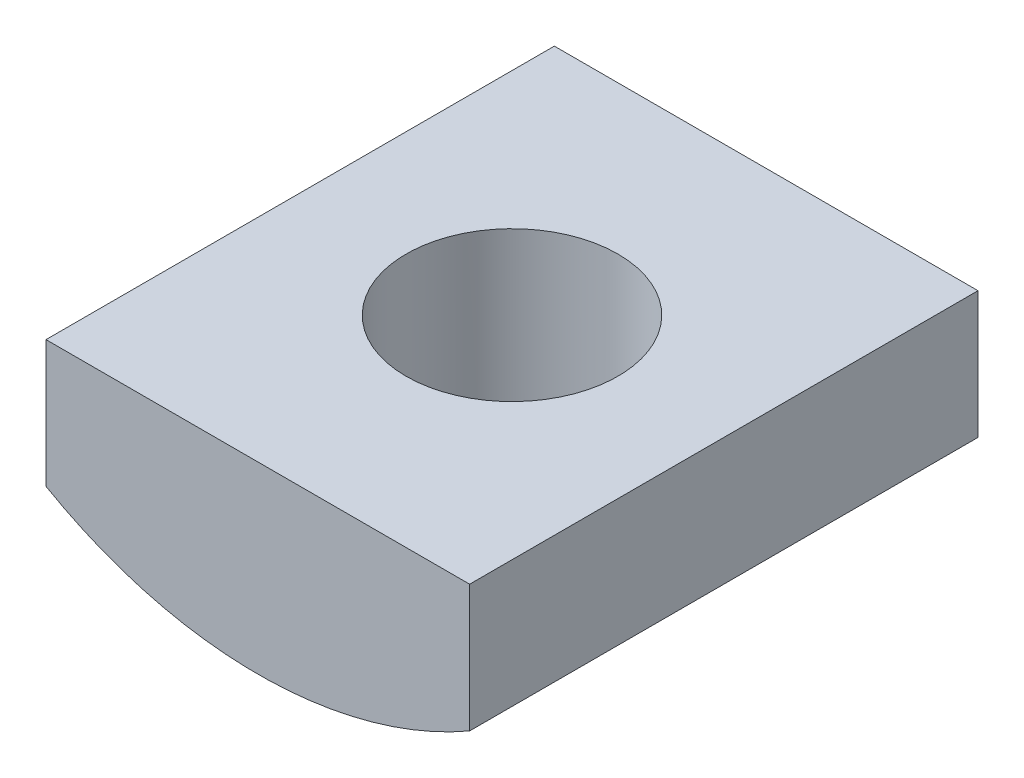
ISO-10303-21;
HEADER;
FILE_DESCRIPTION(('STEP AP214'),'2;1');
FILE_NAME('part.step','',(''),(''),'','','');
FILE_SCHEMA(('AUTOMOTIVE_DESIGN { 1 0 10303 214 1 1 1 1 }'));
ENDSEC;
DATA;
#1=APPLICATION_CONTEXT('core data for automotive mechanical design processes');
#2=APPLICATION_PROTOCOL_DEFINITION('international standard','automotive_design',2000,#1);
#3=PRODUCT_CONTEXT('',#1,'mechanical');
#4=PRODUCT('Part','Part','',(#3));
#5=PRODUCT_RELATED_PRODUCT_CATEGORY('part','',(#4));
#6=PRODUCT_DEFINITION_FORMATION('','',#4);
#7=PRODUCT_DEFINITION_CONTEXT('part definition',#1,'design');
#8=PRODUCT_DEFINITION('design','',#6,#7);
#9=PRODUCT_DEFINITION_SHAPE('','',#8);
#10=(LENGTH_UNIT() NAMED_UNIT(*) SI_UNIT(.MILLI.,.METRE.));
#11=(NAMED_UNIT(*) PLANE_ANGLE_UNIT() SI_UNIT($,.RADIAN.));
#12=(NAMED_UNIT(*) SI_UNIT($,.STERADIAN.) SOLID_ANGLE_UNIT());
#13=UNCERTAINTY_MEASURE_WITH_UNIT(LENGTH_MEASURE(1.E-05),#10,'distance_accuracy_value','');
#14=(GEOMETRIC_REPRESENTATION_CONTEXT(3) GLOBAL_UNCERTAINTY_ASSIGNED_CONTEXT((#13)) GLOBAL_UNIT_ASSIGNED_CONTEXT((#10,
#11,#12)) REPRESENTATION_CONTEXT('',''));
#15=CARTESIAN_POINT('',(0.,0.,0.));
#16=DIRECTION('',(0.,0.,1.));
#17=DIRECTION('',(1.,0.,0.));
#18=AXIS2_PLACEMENT_3D('',#15,#16,#17);
#19=CARTESIAN_POINT('',(-5.,0.,12.));
#20=DIRECTION('',(1.,0.,0.));
#21=DIRECTION('',(0.,1.,0.));
#22=AXIS2_PLACEMENT_3D('',#19,#20,#21);
#23=PLANE('',#22);
#24=DIRECTION('',(0.,-1.,0.));
#25=VECTOR('',#24,1.);
#26=CARTESIAN_POINT('',(-5.,0.,0.));
#27=LINE('',#26,#25);
#28=CARTESIAN_POINT('',(-5.,0.,0.));
#29=VERTEX_POINT('',#28);
#30=CARTESIAN_POINT('',(-5.,-3.,0.));
#31=VERTEX_POINT('',#30);
#32=EDGE_CURVE('E101',#29,#31,#27,.T.);
#33=ORIENTED_EDGE('',*,*,#32,.T.);
#34=DIRECTION('',(0.,0.,-1.));
#35=VECTOR('',#34,1.);
#36=CARTESIAN_POINT('',(-5.,-3.,12.));
#37=LINE('',#36,#35);
#38=CARTESIAN_POINT('',(-5.,-3.,12.));
#39=VERTEX_POINT('',#38);
#40=EDGE_CURVE('E11',#39,#31,#37,.T.);
#41=ORIENTED_EDGE('',*,*,#40,.F.);
#42=DIRECTION('',(0.,-1.,0.));
#43=VECTOR('',#42,1.);
#44=CARTESIAN_POINT('',(-5.,0.,12.));
#45=LINE('',#44,#43);
#46=CARTESIAN_POINT('',(-5.,0.,12.));
#47=VERTEX_POINT('',#46);
#48=EDGE_CURVE('E88',#47,#39,#45,.T.);
#49=ORIENTED_EDGE('',*,*,#48,.F.);
#50=DIRECTION('',(0.,0.,-1.));
#51=VECTOR('',#50,1.);
#52=CARTESIAN_POINT('',(-5.,0.,12.));
#53=LINE('',#52,#51);
#54=EDGE_CURVE('E97',#47,#29,#53,.T.);
#55=ORIENTED_EDGE('',*,*,#54,.T.);
#56=EDGE_LOOP('',(#33,#41,#49,#55));
#57=FACE_BOUND('',#56,.T.);
#58=ADVANCED_FACE('F33',(#57),#23,.F.);
#59=CARTESIAN_POINT('',(0.,5.66025403784439,12.));
#60=DIRECTION('',(0.,0.,-1.));
#61=DIRECTION('',(-1.,0.,0.));
#62=AXIS2_PLACEMENT_3D('',#59,#60,#61);
#63=CYLINDRICAL_SURFACE('',#62,10.);
#64=CARTESIAN_POINT('',(0.,-4.33974596215561,8.5));
#65=CARTESIAN_POINT('',(0.138126814449551,-4.33974362662248,8.49999612376974));
#66=CARTESIAN_POINT('',(0.276296929717938,-4.33685559768605,8.48851408204369));
#67=CARTESIAN_POINT('',(0.54867720628422,-4.32561452598718,8.44295808115499));
#68=CARTESIAN_POINT('',(0.682885078117898,-4.31725838582188,8.40887131743691));
#69=CARTESIAN_POINT('',(0.943368120304293,-4.29600640102282,8.31926791089652));
#70=CARTESIAN_POINT('',(1.06965260571667,-4.28311600952325,8.26377700214122));
#71=CARTESIAN_POINT('',(1.31112021984071,-4.2541683589493,8.13303101659193));
#72=CARTESIAN_POINT('',(1.4263029739146,-4.23811099305822,8.05777527313505));
#73=CARTESIAN_POINT('',(1.64466987883486,-4.2042028553505,7.8879986839097));
#74=CARTESIAN_POINT('',(1.74759281676843,-4.18632441462438,7.79314737506823));
#75=CARTESIAN_POINT('',(1.93624821200553,-4.15097296412122,7.58757965848494));
#76=CARTESIAN_POINT('',(2.02197872824865,-4.13350000032007,7.47686146175511));
#77=CARTESIAN_POINT('',(2.17504423799829,-4.10065889045842,7.24067462210501));
#78=CARTESIAN_POINT('',(2.2420870265419,-4.08532586990246,7.11501128198545));
#79=CARTESIAN_POINT('',(2.35399484758457,-4.05890420912255,6.85375264723328));
#80=CARTESIAN_POINT('',(2.39886342573357,-4.04781489039592,6.71815894444664));
#81=CARTESIAN_POINT('',(2.46425806134127,-4.03142057376099,6.44376083633057));
#82=CARTESIAN_POINT('',(2.48525378055342,-4.02600414543913,6.30507517327001));
#83=CARTESIAN_POINT('',(2.50376962511068,-4.02123533648214,6.02605238500109));
#84=CARTESIAN_POINT('',(2.50129356969685,-4.02188196928776,5.88571553217977));
#85=CARTESIAN_POINT('',(2.47331087439951,-4.02906605410256,5.61097365375775));
#86=CARTESIAN_POINT('',(2.44836390031772,-4.03546034561051,5.47650729755778));
#87=CARTESIAN_POINT('',(2.37704031150499,-4.0531911233401,5.2137315818149));
#88=CARTESIAN_POINT('',(2.33066217011565,-4.06452796164293,5.08542266161847));
#89=CARTESIAN_POINT('',(2.21731579656197,-4.09099786058326,4.83710330624645));
#90=CARTESIAN_POINT('',(2.1501444453882,-4.10616808665255,4.71718971368405));
#91=CARTESIAN_POINT('',(1.99726046002491,-4.13857447625546,4.49013548373863));
#92=CARTESIAN_POINT('',(1.91154458134806,-4.15581100106608,4.38299708655458));
#93=CARTESIAN_POINT('',(1.72110570780203,-4.19101063782047,4.18132730717599));
#94=CARTESIAN_POINT('',(1.61591043027643,-4.20898045345563,4.08724251656442));
#95=CARTESIAN_POINT('',(1.39101986250616,-4.24317872180155,3.9179645958935));
#96=CARTESIAN_POINT('',(1.27132412951324,-4.25940712131241,3.84277204289406));
#97=CARTESIAN_POINT('',(1.02019314780232,-4.28837483039212,3.71324902295936));
#98=CARTESIAN_POINT('',(0.888718988681037,-4.3011019642844,3.65899109957595));
#99=CARTESIAN_POINT('',(0.618126680238136,-4.32154457867922,3.57347115715071));
#100=CARTESIAN_POINT('',(0.47900999858414,-4.32926101781029,3.54220473930311));
#101=CARTESIAN_POINT('',(0.200899950650044,-4.33867095001186,3.50423739073527));
#102=CARTESIAN_POINT('',(0.0619945333136819,-4.3405135206269,3.4969282898745));
#103=CARTESIAN_POINT('',(-0.215054791335849,-4.33839270906315,3.50541500342582));
#104=CARTESIAN_POINT('',(-0.353198766074328,-4.33442984951983,3.52120873799856));
#105=CARTESIAN_POINT('',(-0.622690447960819,-4.32123898094479,3.57495151398563));
#106=CARTESIAN_POINT('',(-0.754108531614584,-4.31208986525208,3.61256877246162));
#107=CARTESIAN_POINT('',(-1.00876215408753,-4.28955773939157,3.7085118067141));
#108=CARTESIAN_POINT('',(-1.13199686505442,-4.27617430165526,3.76683967385537));
#109=CARTESIAN_POINT('',(-1.36920522404972,-4.24630109425931,3.9037268814578));
#110=CARTESIAN_POINT('',(-1.48297573639294,-4.22976041826561,3.98262685399428));
#111=CARTESIAN_POINT('',(-1.69587768940552,-4.19548778195148,4.15798318132862));
#112=CARTESIAN_POINT('',(-1.79500659828875,-4.17775561637139,4.25444256602941));
#113=CARTESIAN_POINT('',(-1.97831761345414,-4.14256191148059,4.46500326807285));
#114=CARTESIAN_POINT('',(-2.06207311270184,-4.12511769853025,4.57947950499927));
#115=CARTESIAN_POINT('',(-2.20918459835604,-4.0929606018563,4.82122105744763));
#116=CARTESIAN_POINT('',(-2.27254149026901,-4.07824759690502,4.94848580495074));
#117=CARTESIAN_POINT('',(-2.37658570101223,-4.05338087410226,5.21150953734373));
#118=CARTESIAN_POINT('',(-2.41740732773931,-4.0432002159137,5.34721271385383));
#119=CARTESIAN_POINT('',(-2.47557609990489,-4.02852502922147,5.62384939642549));
#120=CARTESIAN_POINT('',(-2.49292837912652,-4.02402925719606,5.76478175170242));
#121=CARTESIAN_POINT('',(-2.50339765056083,-4.02132764917174,6.04353503976935));
#122=CARTESIAN_POINT('',(-2.49719649630131,-4.02294484103596,6.18132905854408));
#123=CARTESIAN_POINT('',(-2.46229546385366,-4.03187777887704,6.45383981444378));
#124=CARTESIAN_POINT('',(-2.43359603781098,-4.03919341033293,6.58855661335532));
#125=CARTESIAN_POINT('',(-2.35488553240495,-4.05860030688783,6.85034743177644));
#126=CARTESIAN_POINT('',(-2.30500234113404,-4.07066288276618,6.97746217540055));
#127=CARTESIAN_POINT('',(-2.18544152267504,-4.09820855756401,7.22160897118928));
#128=CARTESIAN_POINT('',(-2.11576115005696,-4.1136921308337,7.33863962197814));
#129=CARTESIAN_POINT('',(-1.95644624772858,-4.14683986654899,7.56259104833676));
#130=CARTESIAN_POINT('',(-1.86633860485376,-4.16455037601863,7.66916845570661));
#131=CARTESIAN_POINT('',(-1.66964895198289,-4.1998797495933,7.86591174132566));
#132=CARTESIAN_POINT('',(-1.56306303543524,-4.21749859093983,7.95607371685494));
#133=CARTESIAN_POINT('',(-1.33411264450432,-4.25104022295011,8.11901884760768));
#134=CARTESIAN_POINT('',(-1.21149737052731,-4.26692651825344,8.19145768945263));
#135=CARTESIAN_POINT('',(-0.955443432517458,-4.29482804507422,8.31457910490088));
#136=CARTESIAN_POINT('',(-0.822012605727898,-4.30684604881863,8.36527726774756));
#137=CARTESIAN_POINT('',(-0.574017088739118,-4.32388028824798,8.43595305054942));
#138=CARTESIAN_POINT('',(-0.460633618180113,-4.32978904636712,8.45991873842239));
#139=CARTESIAN_POINT('',(-0.231510119227139,-4.33772271602142,8.4919432393699));
#140=CARTESIAN_POINT('',(-0.115770268737694,-4.33974791967052,8.50000324884217));
#141=CARTESIAN_POINT('',(0.,-4.33974596215561,8.5));
#142=B_SPLINE_CURVE_WITH_KNOTS('',3,(#64,#65,#66,#67,#68,#69,#70,#71,#72,#73,#74,#75,#76,#77,
#78,#79,#80,#81,#82,#83,#84,#85,#86,#87,#88,#89,#90,#91,#92,#93,#94,#95,#96,#97,#98,#99,#100,
#101,#102,#103,#104,#105,#106,#107,#108,#109,#110,#111,#112,#113,#114,#115,#116,#117,#118,#119,
#120,#121,#122,#123,#124,#125,#126,#127,#128,#129,#130,#131,#132,#133,#134,#135,#136,#137,#138,
#139,#140,#141),.UNSPECIFIED.,.T.,.F.,(4,2,2,2,2,2,2,2,2,2,2,2,2,2,2,2,2,2,2,2,2,2,2,2,2,2,2,2,
2,2,2,2,2,2,2,2,2,2,4),(0.,0.413956187453149,0.828147062939833,1.24184150381018,
1.65554990028221,2.07690725728565,2.4983121596677,2.92597745909678,3.3535743528228,
3.77260491835116,4.19156730193363,4.60037495017231,5.00921172448932,5.42217546462,
5.83521151399139,6.26002501620567,6.68485149269279,7.11113715020724,7.53734122819939,
7.95263848254328,8.36789835193439,8.7770045752893,9.18615212209352,9.60255979281121,
10.0190393835223,10.4457418201299,10.8724253125471,11.2965375769764,11.7205570543048,
12.1323963400748,12.5442273493652,12.9536066760888,13.3630428023797,13.7831596069298,
14.2033761629383,14.6312030917578,15.0587227304538,15.4057040491338,15.752659267482),.UNSPECIFIED.);
#143=CARTESIAN_POINT('',(0.,-4.33974596215561,8.5));
#144=VERTEX_POINT('',#143);
#145=EDGE_CURVE('E36',#144,#144,#142,.T.);
#146=ORIENTED_EDGE('',*,*,#145,.T.);
#147=EDGE_LOOP('',(#146));
#148=FACE_BOUND('',#147,.T.);
#149=CARTESIAN_POINT('',(0.,5.66025403784439,0.));
#150=DIRECTION('',(0.,0.,1.));
#151=DIRECTION('',(1.,0.,0.));
#152=AXIS2_PLACEMENT_3D('',#149,#150,#151);
#153=CIRCLE('',#152,10.);
#154=CARTESIAN_POINT('',(5.,-3.,0.));
#155=VERTEX_POINT('',#154);
#156=EDGE_CURVE('E92',#31,#155,#153,.T.);
#157=ORIENTED_EDGE('',*,*,#156,.T.);
#158=DIRECTION('',(0.,0.,-1.));
#159=VECTOR('',#158,1.);
#160=CARTESIAN_POINT('',(5.,-3.,12.));
#161=LINE('',#160,#159);
#162=CARTESIAN_POINT('',(5.,-3.,12.));
#163=VERTEX_POINT('',#162);
#164=EDGE_CURVE('E45',#163,#155,#161,.T.);
#165=ORIENTED_EDGE('',*,*,#164,.F.);
#166=CARTESIAN_POINT('',(0.,5.66025403784439,12.));
#167=DIRECTION('',(0.,0.,1.));
#168=DIRECTION('',(1.,0.,0.));
#169=AXIS2_PLACEMENT_3D('',#166,#167,#168);
#170=CIRCLE('',#169,10.);
#171=EDGE_CURVE('E83',#39,#163,#170,.T.);
#172=ORIENTED_EDGE('',*,*,#171,.F.);
#173=ORIENTED_EDGE('',*,*,#40,.T.);
#174=EDGE_LOOP('',(#157,#165,#172,#173));
#175=FACE_BOUND('',#174,.T.);
#176=ADVANCED_FACE('F91',(#148,#175),#63,.T.);
#177=CARTESIAN_POINT('',(5.,0.,12.));
#178=DIRECTION('',(-1.,0.,0.));
#179=DIRECTION('',(0.,-1.,0.));
#180=AXIS2_PLACEMENT_3D('',#177,#178,#179);
#181=PLANE('',#180);
#182=DIRECTION('',(0.,1.,0.));
#183=VECTOR('',#182,1.);
#184=CARTESIAN_POINT('',(5.,0.,0.));
#185=LINE('',#184,#183);
#186=CARTESIAN_POINT('',(5.,0.,0.));
#187=VERTEX_POINT('',#186);
#188=EDGE_CURVE('E70',#155,#187,#185,.T.);
#189=ORIENTED_EDGE('',*,*,#188,.T.);
#190=DIRECTION('',(0.,0.,-1.));
#191=VECTOR('',#190,1.);
#192=CARTESIAN_POINT('',(5.,0.,12.));
#193=LINE('',#192,#191);
#194=CARTESIAN_POINT('',(5.,0.,12.));
#195=VERTEX_POINT('',#194);
#196=EDGE_CURVE('E93',#195,#187,#193,.T.);
#197=ORIENTED_EDGE('',*,*,#196,.F.);
#198=DIRECTION('',(0.,1.,0.));
#199=VECTOR('',#198,1.);
#200=CARTESIAN_POINT('',(5.,0.,12.));
#201=LINE('',#200,#199);
#202=EDGE_CURVE('E86',#163,#195,#201,.T.);
#203=ORIENTED_EDGE('',*,*,#202,.F.);
#204=ORIENTED_EDGE('',*,*,#164,.T.);
#205=EDGE_LOOP('',(#189,#197,#203,#204));
#206=FACE_BOUND('',#205,.T.);
#207=ADVANCED_FACE('F95',(#206),#181,.F.);
#208=CARTESIAN_POINT('',(-5.,0.,12.));
#209=DIRECTION('',(0.,-1.,0.));
#210=DIRECTION('',(0.,0.,-1.));
#211=AXIS2_PLACEMENT_3D('',#208,#209,#210);
#212=PLANE('',#211);
#213=CARTESIAN_POINT('',(0.,0.,6.));
#214=DIRECTION('',(0.,1.,0.));
#215=DIRECTION('',(0.,0.,1.));
#216=AXIS2_PLACEMENT_3D('',#213,#214,#215);
#217=CIRCLE('',#216,2.5);
#218=CARTESIAN_POINT('',(0.,0.,8.5));
#219=VERTEX_POINT('',#218);
#220=EDGE_CURVE('E114',#219,#219,#217,.T.);
#221=ORIENTED_EDGE('',*,*,#220,.F.);
#222=EDGE_LOOP('',(#221));
#223=FACE_BOUND('',#222,.T.);
#224=DIRECTION('',(-1.,0.,0.));
#225=VECTOR('',#224,1.);
#226=CARTESIAN_POINT('',(-5.,0.,0.));
#227=LINE('',#226,#225);
#228=EDGE_CURVE('E76',#187,#29,#227,.T.);
#229=ORIENTED_EDGE('',*,*,#228,.T.);
#230=ORIENTED_EDGE('',*,*,#54,.F.);
#231=DIRECTION('',(-1.,0.,0.));
#232=VECTOR('',#231,1.);
#233=CARTESIAN_POINT('',(-5.,0.,12.));
#234=LINE('',#233,#232);
#235=EDGE_CURVE('E53',#195,#47,#234,.T.);
#236=ORIENTED_EDGE('',*,*,#235,.F.);
#237=ORIENTED_EDGE('',*,*,#196,.T.);
#238=EDGE_LOOP('',(#229,#230,#236,#237));
#239=FACE_BOUND('',#238,.T.);
#240=ADVANCED_FACE('F108',(#223,#239),#212,.F.);
#241=CARTESIAN_POINT('',(0.,5.66025403784439,12.));
#242=DIRECTION('',(0.,0.,1.));
#243=DIRECTION('',(1.,0.,0.));
#244=AXIS2_PLACEMENT_3D('',#241,#242,#243);
#245=PLANE('',#244);
#246=ORIENTED_EDGE('',*,*,#48,.T.);
#247=ORIENTED_EDGE('',*,*,#171,.T.);
#248=ORIENTED_EDGE('',*,*,#202,.T.);
#249=ORIENTED_EDGE('',*,*,#235,.T.);
#250=EDGE_LOOP('',(#246,#247,#248,#249));
#251=FACE_BOUND('',#250,.T.);
#252=ADVANCED_FACE('F84',(#251),#245,.T.);
#253=CARTESIAN_POINT('',(0.,5.66025403784439,0.));
#254=DIRECTION('',(0.,0.,1.));
#255=DIRECTION('',(1.,0.,0.));
#256=AXIS2_PLACEMENT_3D('',#253,#254,#255);
#257=PLANE('',#256);
#258=ORIENTED_EDGE('',*,*,#32,.F.);
#259=ORIENTED_EDGE('',*,*,#228,.F.);
#260=ORIENTED_EDGE('',*,*,#188,.F.);
#261=ORIENTED_EDGE('',*,*,#156,.F.);
#262=EDGE_LOOP('',(#258,#259,#260,#261));
#263=FACE_BOUND('',#262,.T.);
#264=ADVANCED_FACE('F111',(#263),#257,.F.);
#265=CARTESIAN_POINT('',(0.,0.,6.));
#266=DIRECTION('',(0.,1.,0.));
#267=DIRECTION('',(0.,0.,1.));
#268=AXIS2_PLACEMENT_3D('',#265,#266,#267);
#269=CYLINDRICAL_SURFACE('',#268,2.5);
#270=ORIENTED_EDGE('',*,*,#220,.T.);
#271=EDGE_LOOP('',(#270));
#272=FACE_BOUND('',#271,.T.);
#273=ORIENTED_EDGE('',*,*,#145,.F.);
#274=EDGE_LOOP('',(#273));
#275=FACE_BOUND('',#274,.T.);
#276=ADVANCED_FACE('F122',(#272,#275),#269,.F.);
#277=CLOSED_SHELL('',(#58,#176,#207,#240,#252,#264,#276));
#278=MANIFOLD_SOLID_BREP('B2',#277);
#279=ADVANCED_BREP_SHAPE_REPRESENTATION('',(#18,#278),#14);
#280=SHAPE_DEFINITION_REPRESENTATION(#9,#279);
ENDSEC;
END-ISO-10303-21;
